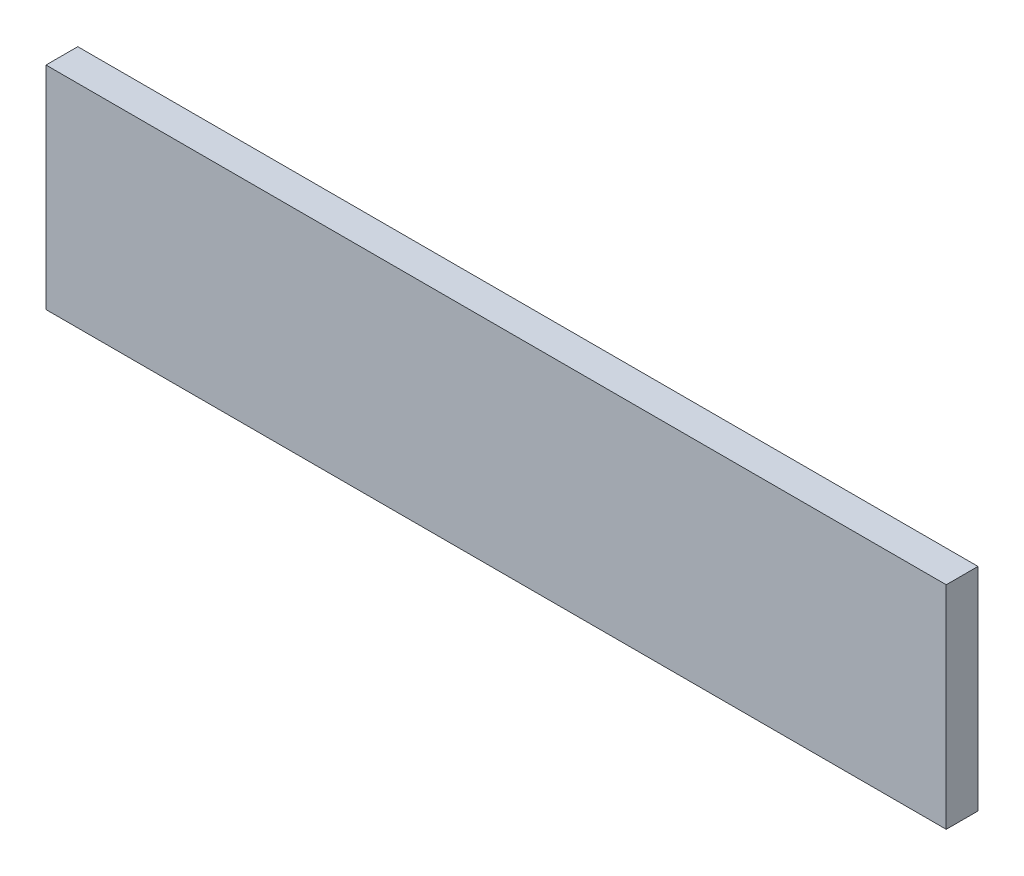
ISO-10303-21;
HEADER;
FILE_DESCRIPTION(('STEP AP214'),'2;1');
FILE_NAME('part.step','',(''),(''),'','','');
FILE_SCHEMA(('AUTOMOTIVE_DESIGN { 1 0 10303 214 1 1 1 1 }'));
ENDSEC;
DATA;
#1=APPLICATION_CONTEXT('core data for automotive mechanical design processes');
#2=APPLICATION_PROTOCOL_DEFINITION('international standard','automotive_design',2000,#1);
#3=PRODUCT_CONTEXT('',#1,'mechanical');
#4=PRODUCT('Part','Part','',(#3));
#5=PRODUCT_RELATED_PRODUCT_CATEGORY('part','',(#4));
#6=PRODUCT_DEFINITION_FORMATION('','',#4);
#7=PRODUCT_DEFINITION_CONTEXT('part definition',#1,'design');
#8=PRODUCT_DEFINITION('design','',#6,#7);
#9=PRODUCT_DEFINITION_SHAPE('','',#8);
#10=(LENGTH_UNIT() NAMED_UNIT(*) SI_UNIT(.MILLI.,.METRE.));
#11=(NAMED_UNIT(*) PLANE_ANGLE_UNIT() SI_UNIT($,.RADIAN.));
#12=(NAMED_UNIT(*) SI_UNIT($,.STERADIAN.) SOLID_ANGLE_UNIT());
#13=UNCERTAINTY_MEASURE_WITH_UNIT(LENGTH_MEASURE(1.E-05),#10,'distance_accuracy_value','');
#14=(GEOMETRIC_REPRESENTATION_CONTEXT(3) GLOBAL_UNCERTAINTY_ASSIGNED_CONTEXT((#13)) GLOBAL_UNIT_ASSIGNED_CONTEXT((#10,
#11,#12)) REPRESENTATION_CONTEXT('',''));
#15=CARTESIAN_POINT('',(0.,0.,0.));
#16=DIRECTION('',(0.,0.,1.));
#17=DIRECTION('',(1.,0.,0.));
#18=AXIS2_PLACEMENT_3D('',#15,#16,#17);
#19=CARTESIAN_POINT('',(0.,0.,6.));
#20=DIRECTION('',(1.,0.,0.));
#21=DIRECTION('',(0.,0.,-1.));
#22=AXIS2_PLACEMENT_3D('',#19,#20,#21);
#23=PLANE('',#22);
#24=DIRECTION('',(0.,-1.,0.));
#25=VECTOR('',#24,1.);
#26=CARTESIAN_POINT('',(0.,0.,0.));
#27=LINE('',#26,#25);
#28=CARTESIAN_POINT('',(0.,40.,0.));
#29=VERTEX_POINT('',#28);
#30=CARTESIAN_POINT('',(0.,0.,0.));
#31=VERTEX_POINT('',#30);
#32=EDGE_CURVE('E104',#29,#31,#27,.T.);
#33=ORIENTED_EDGE('',*,*,#32,.T.);
#34=DIRECTION('',(0.,0.,-1.));
#35=VECTOR('',#34,1.);
#36=CARTESIAN_POINT('',(0.,0.,6.));
#37=LINE('',#36,#35);
#38=CARTESIAN_POINT('',(0.,0.,6.));
#39=VERTEX_POINT('',#38);
#40=EDGE_CURVE('E11',#39,#31,#37,.T.);
#41=ORIENTED_EDGE('',*,*,#40,.F.);
#42=DIRECTION('',(0.,-1.,0.));
#43=VECTOR('',#42,1.);
#44=CARTESIAN_POINT('',(0.,0.,6.));
#45=LINE('',#44,#43);
#46=CARTESIAN_POINT('',(0.,40.,6.));
#47=VERTEX_POINT('',#46);
#48=EDGE_CURVE('E89',#47,#39,#45,.T.);
#49=ORIENTED_EDGE('',*,*,#48,.F.);
#50=DIRECTION('',(0.,0.,-1.));
#51=VECTOR('',#50,1.);
#52=CARTESIAN_POINT('',(0.,40.,6.));
#53=LINE('',#52,#51);
#54=EDGE_CURVE('E100',#47,#29,#53,.T.);
#55=ORIENTED_EDGE('',*,*,#54,.T.);
#56=EDGE_LOOP('',(#33,#41,#49,#55));
#57=FACE_BOUND('',#56,.T.);
#58=ADVANCED_FACE('F38',(#57),#23,.F.);
#59=CARTESIAN_POINT('',(0.,0.,6.));
#60=DIRECTION('',(0.,1.,0.));
#61=DIRECTION('',(0.,0.,1.));
#62=AXIS2_PLACEMENT_3D('',#59,#60,#61);
#63=PLANE('',#62);
#64=DIRECTION('',(1.,0.,0.));
#65=VECTOR('',#64,1.);
#66=CARTESIAN_POINT('',(0.,0.,0.));
#67=LINE('',#66,#65);
#68=CARTESIAN_POINT('',(170.,0.,0.));
#69=VERTEX_POINT('',#68);
#70=EDGE_CURVE('E93',#31,#69,#67,.T.);
#71=ORIENTED_EDGE('',*,*,#70,.T.);
#72=DIRECTION('',(0.,0.,-1.));
#73=VECTOR('',#72,1.);
#74=CARTESIAN_POINT('',(170.,0.,6.));
#75=LINE('',#74,#73);
#76=CARTESIAN_POINT('',(170.,0.,6.));
#77=VERTEX_POINT('',#76);
#78=EDGE_CURVE('E46',#77,#69,#75,.T.);
#79=ORIENTED_EDGE('',*,*,#78,.F.);
#80=DIRECTION('',(1.,0.,0.));
#81=VECTOR('',#80,1.);
#82=CARTESIAN_POINT('',(0.,0.,6.));
#83=LINE('',#82,#81);
#84=EDGE_CURVE('E84',#39,#77,#83,.T.);
#85=ORIENTED_EDGE('',*,*,#84,.F.);
#86=ORIENTED_EDGE('',*,*,#40,.T.);
#87=EDGE_LOOP('',(#71,#79,#85,#86));
#88=FACE_BOUND('',#87,.T.);
#89=ADVANCED_FACE('F92',(#88),#63,.F.);
#90=CARTESIAN_POINT('',(170.,0.,6.));
#91=DIRECTION('',(-1.,0.,0.));
#92=DIRECTION('',(0.,0.,1.));
#93=AXIS2_PLACEMENT_3D('',#90,#91,#92);
#94=PLANE('',#93);
#95=DIRECTION('',(0.,1.,0.));
#96=VECTOR('',#95,1.);
#97=CARTESIAN_POINT('',(170.,0.,0.));
#98=LINE('',#97,#96);
#99=CARTESIAN_POINT('',(170.,40.,0.));
#100=VERTEX_POINT('',#99);
#101=EDGE_CURVE('E71',#69,#100,#98,.T.);
#102=ORIENTED_EDGE('',*,*,#101,.T.);
#103=DIRECTION('',(0.,0.,-1.));
#104=VECTOR('',#103,1.);
#105=CARTESIAN_POINT('',(170.,40.,6.));
#106=LINE('',#105,#104);
#107=CARTESIAN_POINT('',(170.,40.,6.));
#108=VERTEX_POINT('',#107);
#109=EDGE_CURVE('E94',#108,#100,#106,.T.);
#110=ORIENTED_EDGE('',*,*,#109,.F.);
#111=DIRECTION('',(0.,1.,0.));
#112=VECTOR('',#111,1.);
#113=CARTESIAN_POINT('',(170.,0.,6.));
#114=LINE('',#113,#112);
#115=EDGE_CURVE('E87',#77,#108,#114,.T.);
#116=ORIENTED_EDGE('',*,*,#115,.F.);
#117=ORIENTED_EDGE('',*,*,#78,.T.);
#118=EDGE_LOOP('',(#102,#110,#116,#117));
#119=FACE_BOUND('',#118,.T.);
#120=ADVANCED_FACE('F95',(#119),#94,.F.);
#121=CARTESIAN_POINT('',(0.,40.,6.));
#122=DIRECTION('',(0.,-1.,0.));
#123=DIRECTION('',(0.,0.,-1.));
#124=AXIS2_PLACEMENT_3D('',#121,#122,#123);
#125=PLANE('',#124);
#126=DIRECTION('',(-1.,0.,0.));
#127=VECTOR('',#126,1.);
#128=CARTESIAN_POINT('',(0.,40.,0.));
#129=LINE('',#128,#127);
#130=EDGE_CURVE('E77',#100,#29,#129,.T.);
#131=ORIENTED_EDGE('',*,*,#130,.T.);
#132=ORIENTED_EDGE('',*,*,#54,.F.);
#133=DIRECTION('',(-1.,0.,0.));
#134=VECTOR('',#133,1.);
#135=CARTESIAN_POINT('',(0.,40.,6.));
#136=LINE('',#135,#134);
#137=EDGE_CURVE('E54',#108,#47,#136,.T.);
#138=ORIENTED_EDGE('',*,*,#137,.F.);
#139=ORIENTED_EDGE('',*,*,#109,.T.);
#140=EDGE_LOOP('',(#131,#132,#138,#139));
#141=FACE_BOUND('',#140,.T.);
#142=ADVANCED_FACE('F111',(#141),#125,.F.);
#143=CARTESIAN_POINT('',(0.,40.,6.));
#144=DIRECTION('',(0.,0.,-1.));
#145=DIRECTION('',(-1.,0.,0.));
#146=AXIS2_PLACEMENT_3D('',#143,#144,#145);
#147=PLANE('',#146);
#148=ORIENTED_EDGE('',*,*,#48,.T.);
#149=ORIENTED_EDGE('',*,*,#84,.T.);
#150=ORIENTED_EDGE('',*,*,#115,.T.);
#151=ORIENTED_EDGE('',*,*,#137,.T.);
#152=EDGE_LOOP('',(#148,#149,#150,#151));
#153=FACE_BOUND('',#152,.T.);
#154=ADVANCED_FACE('F85',(#153),#147,.F.);
#155=CARTESIAN_POINT('',(0.,40.,0.));
#156=DIRECTION('',(0.,0.,-1.));
#157=DIRECTION('',(-1.,0.,0.));
#158=AXIS2_PLACEMENT_3D('',#155,#156,#157);
#159=PLANE('',#158);
#160=ORIENTED_EDGE('',*,*,#32,.F.);
#161=ORIENTED_EDGE('',*,*,#130,.F.);
#162=ORIENTED_EDGE('',*,*,#101,.F.);
#163=ORIENTED_EDGE('',*,*,#70,.F.);
#164=EDGE_LOOP('',(#160,#161,#162,#163));
#165=FACE_BOUND('',#164,.T.);
#166=ADVANCED_FACE('F114',(#165),#159,.T.);
#167=CLOSED_SHELL('',(#58,#89,#120,#142,#154,#166));
#168=MANIFOLD_SOLID_BREP('B2',#167);
#169=ADVANCED_BREP_SHAPE_REPRESENTATION('',(#18,#168),#14);
#170=SHAPE_DEFINITION_REPRESENTATION(#9,#169);
ENDSEC;
END-ISO-10303-21;
